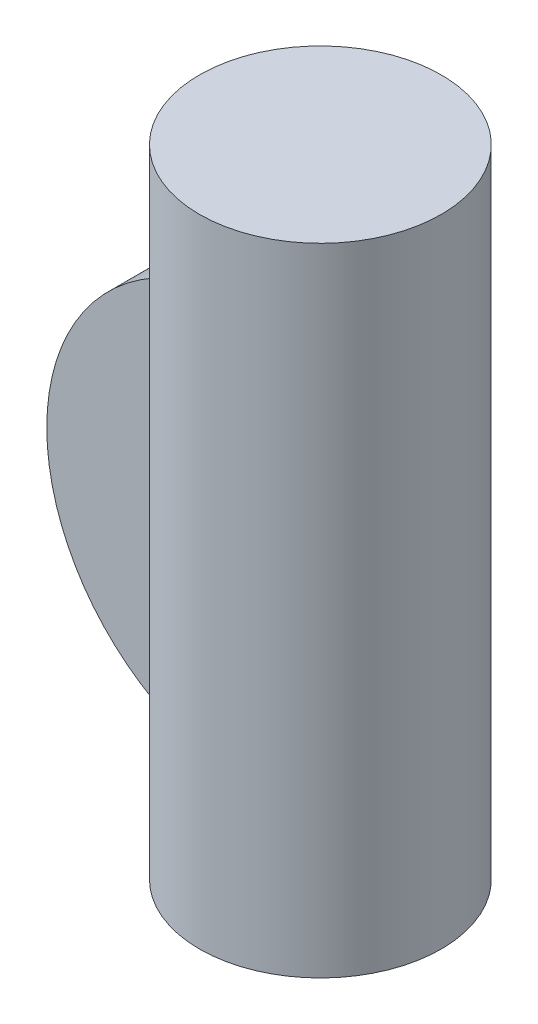
ISO-10303-21;
HEADER;
FILE_DESCRIPTION(('STEP AP214'),'2;1');
FILE_NAME('part.step','',(''),(''),'','','');
FILE_SCHEMA(('AUTOMOTIVE_DESIGN { 1 0 10303 214 1 1 1 1 }'));
ENDSEC;
DATA;
#1=APPLICATION_CONTEXT('core data for automotive mechanical design processes');
#2=APPLICATION_PROTOCOL_DEFINITION('international standard','automotive_design',2000,#1);
#3=PRODUCT_CONTEXT('',#1,'mechanical');
#4=PRODUCT('Part','Part','',(#3));
#5=PRODUCT_RELATED_PRODUCT_CATEGORY('part','',(#4));
#6=PRODUCT_DEFINITION_FORMATION('','',#4);
#7=PRODUCT_DEFINITION_CONTEXT('part definition',#1,'design');
#8=PRODUCT_DEFINITION('design','',#6,#7);
#9=PRODUCT_DEFINITION_SHAPE('','',#8);
#10=(LENGTH_UNIT() NAMED_UNIT(*) SI_UNIT(.MILLI.,.METRE.));
#11=(NAMED_UNIT(*) PLANE_ANGLE_UNIT() SI_UNIT($,.RADIAN.));
#12=(NAMED_UNIT(*) SI_UNIT($,.STERADIAN.) SOLID_ANGLE_UNIT());
#13=UNCERTAINTY_MEASURE_WITH_UNIT(LENGTH_MEASURE(1.E-05),#10,'distance_accuracy_value','');
#14=(GEOMETRIC_REPRESENTATION_CONTEXT(3) GLOBAL_UNCERTAINTY_ASSIGNED_CONTEXT((#13)) GLOBAL_UNIT_ASSIGNED_CONTEXT((#10,
#11,#12)) REPRESENTATION_CONTEXT('',''));
#15=CARTESIAN_POINT('',(0.,0.,0.));
#16=DIRECTION('',(0.,0.,1.));
#17=DIRECTION('',(1.,0.,0.));
#18=AXIS2_PLACEMENT_3D('',#15,#16,#17);
#19=CARTESIAN_POINT('',(0.,12.7,0.));
#20=DIRECTION('',(0.,-1.,0.));
#21=DIRECTION('',(0.,0.,-1.));
#22=AXIS2_PLACEMENT_3D('',#19,#20,#21);
#23=CYLINDRICAL_SURFACE('',#22,2.413);
#24=CARTESIAN_POINT('',(0.,0.,0.));
#25=DIRECTION('',(0.,1.,0.));
#26=DIRECTION('',(0.,0.,1.));
#27=AXIS2_PLACEMENT_3D('',#24,#25,#26);
#28=CIRCLE('',#27,2.413);
#29=CARTESIAN_POINT('',(0.,0.,2.413));
#30=VERTEX_POINT('',#29);
#31=EDGE_CURVE('E103',#30,#30,#28,.T.);
#32=ORIENTED_EDGE('',*,*,#31,.T.);
#33=EDGE_LOOP('',(#32));
#34=FACE_BOUND('',#33,.T.);
#35=CARTESIAN_POINT('',(0.,12.7,0.));
#36=DIRECTION('',(0.,1.,0.));
#37=DIRECTION('',(0.,0.,1.));
#38=AXIS2_PLACEMENT_3D('',#35,#36,#37);
#39=CIRCLE('',#38,2.413);
#40=CARTESIAN_POINT('',(0.,12.7,2.413));
#41=VERTEX_POINT('',#40);
#42=EDGE_CURVE('E67',#41,#41,#39,.T.);
#43=ORIENTED_EDGE('',*,*,#42,.F.);
#44=EDGE_LOOP('',(#43));
#45=FACE_BOUND('',#44,.T.);
#46=DIRECTION('',(0.,-1.,0.));
#47=VECTOR('',#46,1.);
#48=CARTESIAN_POINT('',(-2.05174779151824,12.7,-1.27));
#49=LINE('',#48,#47);
#50=CARTESIAN_POINT('',(-2.05174779151824,10.0044236207643,-1.27));
#51=VERTEX_POINT('',#50);
#52=CARTESIAN_POINT('',(-2.05174779151824,2.69557637923571,-1.27));
#53=VERTEX_POINT('',#52);
#54=EDGE_CURVE('E11',#51,#53,#49,.T.);
#55=ORIENTED_EDGE('',*,*,#54,.F.);
#56=CARTESIAN_POINT('',(0.,10.541,-2.413));
#57=CARTESIAN_POINT('',(-0.124277637249228,10.5409940200185,-2.41299336304963));
#58=CARTESIAN_POINT('',(-0.248758355500067,10.5354113425692,-2.40333297175946));
#59=CARTESIAN_POINT('',(-0.494002380310563,10.5136143992874,-2.36516603636907));
#60=CARTESIAN_POINT('',(-0.614755685070034,10.497373759839,-2.33661273945595));
#61=CARTESIAN_POINT('',(-0.84849211339575,10.4559183213708,-2.26221126559808));
#62=CARTESIAN_POINT('',(-0.961509223811501,10.4307462446565,-2.21644536133677));
#63=CARTESIAN_POINT('',(-1.17795129399248,10.373612624699,-2.10940538553403));
#64=CARTESIAN_POINT('',(-1.28137866647483,10.3416527959062,-2.04813522930966));
#65=CARTESIAN_POINT('',(-1.48423338629655,10.2709555404946,-1.90682899998204));
#66=CARTESIAN_POINT('',(-1.58281960610189,10.2318938890336,-1.82575057314704));
#67=CARTESIAN_POINT('',(-1.76581321737876,10.1521533698034,-1.64943780472773));
#68=CARTESIAN_POINT('',(-1.85020356076299,10.1114726290898,-1.55418669786252));
#69=CARTESIAN_POINT('',(-2.01185971312618,10.0277800285415,-1.33976265924406));
#70=CARTESIAN_POINT('',(-2.08730169113426,9.98500889019922,-1.2191087272989));
#71=CARTESIAN_POINT('',(-2.21651615453764,9.90770101956303,-0.964335378286774));
#72=CARTESIAN_POINT('',(-2.27032181192059,9.87315171532192,-0.830236971227625));
#73=CARTESIAN_POINT('',(-2.34418169051724,9.8243051540268,-0.583160389834326));
#74=CARTESIAN_POINT('',(-2.36909939840019,9.80720354111209,-0.472191619686289));
#75=CARTESIAN_POINT('',(-2.40304368702526,9.78370164835962,-0.246784346127516));
#76=CARTESIAN_POINT('',(-2.41208769441688,9.7772896335322,-0.132349788198802));
#77=CARTESIAN_POINT('',(-2.41378185768347,9.77609690659586,0.096865990521768));
#78=CARTESIAN_POINT('',(-2.40640829735232,9.78133302093031,0.211647473307185));
#79=CARTESIAN_POINT('',(-2.37566187963837,9.80268679310376,0.438030021126774));
#80=CARTESIAN_POINT('',(-2.35227785449406,9.81881204632381,0.549628809504083));
#81=CARTESIAN_POINT('',(-2.29083746132534,9.85968380815242,0.766333326507967));
#82=CARTESIAN_POINT('',(-2.25285639879514,9.88438600652444,0.871469219759344));
#83=CARTESIAN_POINT('',(-2.16355198197181,9.93974629305387,1.07419596879215));
#84=CARTESIAN_POINT('',(-2.112223553229,9.97040664528091,1.17178393662869));
#85=CARTESIAN_POINT('',(-1.98804553494693,10.0402587502311,1.37348348059103));
#86=CARTESIAN_POINT('',(-1.91305416570196,10.0800272358213,1.47607830241487));
#87=CARTESIAN_POINT('',(-1.74804635345664,10.1601496204782,1.66822114510697));
#88=CARTESIAN_POINT('',(-1.65801685218052,10.2005040002517,1.75775769922445));
#89=CARTESIAN_POINT('',(-1.45282681720777,10.2828578770022,1.93184218344593));
#90=CARTESIAN_POINT('',(-1.33595635743975,10.3244935334549,2.01456778903394));
#91=CARTESIAN_POINT('',(-1.08740955700763,10.3995467016589,2.15886888745384));
#92=CARTESIAN_POINT('',(-0.955742459094785,10.4329693025854,2.22045748714923));
#93=CARTESIAN_POINT('',(-0.690573861147793,10.4857690045796,2.31606316964933));
#94=CARTESIAN_POINT('',(-0.557814827883166,10.505950916336,2.35167894441401));
#95=CARTESIAN_POINT('',(-0.286915343507005,10.5333749000779,2.3998162976974));
#96=CARTESIAN_POINT('',(-0.148780506736776,10.5406301204284,2.41236134299281));
#97=CARTESIAN_POINT('',(0.110480615109437,10.5412989577698,2.4135159417579));
#98=CARTESIAN_POINT('',(0.231601331523145,10.5363108314319,2.40488928405349));
#99=CARTESIAN_POINT('',(0.470351993641351,10.5162447972409,2.36978740966585));
#100=CARTESIAN_POINT('',(0.587981896117345,10.5011667644938,2.34331197204842));
#101=CARTESIAN_POINT('',(0.815243367366012,10.462542108815,2.27418048620141));
#102=CARTESIAN_POINT('',(0.924955000754998,10.4391010348016,2.23172575899148));
#103=CARTESIAN_POINT('',(1.13575746981125,10.3856382300467,2.13218763608001));
#104=CARTESIAN_POINT('',(1.23684628368958,10.3556149618402,2.07510082209646));
#105=CARTESIAN_POINT('',(1.43888724822221,10.2878405204102,1.94122473706034));
#106=CARTESIAN_POINT('',(1.5387271493804,10.2496100519732,1.86300214228886));
#107=CARTESIAN_POINT('',(1.72463887696221,10.1710354029841,1.69237663170828));
#108=CARTESIAN_POINT('',(1.81069459977375,10.1306888222147,1.5999573736822));
#109=CARTESIAN_POINT('',(1.97664578442751,10.0468826764234,1.391119100108));
#110=CARTESIAN_POINT('',(2.05470893242076,10.0035953329166,1.27316388896186));
#111=CARTESIAN_POINT('',(2.18974765456304,9.92430285549781,1.02354341292712));
#112=CARTESIAN_POINT('',(2.2467505892016,9.88828830089607,0.891896223187658));
#113=CARTESIAN_POINT('',(2.32732248486878,9.8356640986138,0.647287305484953));
#114=CARTESIAN_POINT('',(2.35543805271512,9.81655013360204,0.536365173091407));
#115=CARTESIAN_POINT('',(2.39569074505154,9.78886072312772,0.31042359747855));
#116=CARTESIAN_POINT('',(2.40784666421774,9.7802728825029,0.195409137852801));
#117=CARTESIAN_POINT('',(2.4155106034754,9.77488201669864,-0.0357196611619962));
#118=CARTESIAN_POINT('',(2.41098122290393,9.77810546684024,-0.151835888877429));
#119=CARTESIAN_POINT('',(2.38547130861108,9.79590115916865,-0.381379951471876));
#120=CARTESIAN_POINT('',(2.36448046464044,9.81048051381953,-0.494806055569871));
#121=CARTESIAN_POINT('',(2.30778588617826,9.8485318164777,-0.713584798834544));
#122=CARTESIAN_POINT('',(2.27240903604877,9.87180531368022,-0.819058760763659));
#123=CARTESIAN_POINT('',(2.18828821460808,9.92468001668123,-1.02280335365467));
#124=CARTESIAN_POINT('',(2.13953938297278,9.95428352238838,-1.12107134896793));
#125=CARTESIAN_POINT('',(2.02137030130052,10.0220374463545,-1.32379882609085));
#126=CARTESIAN_POINT('',(1.949920099365,10.0608017340054,-1.42686979460781));
#127=CARTESIAN_POINT('',(1.79219802627501,10.1394966575978,-1.62055993545985));
#128=CARTESIAN_POINT('',(1.70591294975642,10.179428306161,-1.7111678832798));
#129=CARTESIAN_POINT('',(1.50763234840602,10.262097426136,-1.88934133554991));
#130=CARTESIAN_POINT('',(1.39375186370449,10.3045228996838,-1.974973345334));
#131=CARTESIAN_POINT('',(1.15079430635549,10.3819161599196,-2.12570475084521));
#132=CARTESIAN_POINT('',(1.02172585136317,10.4168881443508,-2.19081571380201));
#133=CARTESIAN_POINT('',(0.775887217839013,10.4701199692136,-2.28797014814794));
#134=CARTESIAN_POINT('',(0.661025029190498,10.4902474887708,-2.32383890813863));
#135=CARTESIAN_POINT('',(0.426193087641429,10.5209426327873,-2.37810038989842));
#136=CARTESIAN_POINT('',(0.306238790322241,10.5315372838142,-2.39654252527444));
#137=CARTESIAN_POINT('',(0.154682634412064,10.5382596582669,-2.40823725755627));
#138=CARTESIAN_POINT('',(0.123787155969279,10.5392856545917,-2.4100214431603));
#139=CARTESIAN_POINT('',(0.0619319944020345,10.5406566123504,-2.41240371408687));
#140=CARTESIAN_POINT('',(0.0309723038745233,10.5410014903229,-2.41300165405175));
#141=CARTESIAN_POINT('',(0.,10.541,-2.413));
#142=B_SPLINE_CURVE_WITH_KNOTS('',3,(#56,#57,#58,#59,#60,#61,#62,#63,#64,#65,#66,#67,#68,#69,
#70,#71,#72,#73,#74,#75,#76,#77,#78,#79,#80,#81,#82,#83,#84,#85,#86,#87,#88,#89,#90,#91,#92,#93,
#94,#95,#96,#97,#98,#99,#100,#101,#102,#103,#104,#105,#106,#107,#108,#109,#110,#111,#112,#113,
#114,#115,#116,#117,#118,#119,#120,#121,#122,#123,#124,#125,#126,#127,#128,#129,#130,#131,#132,
#133,#134,#135,#136,#137,#138,#139,#140,#141),.UNSPECIFIED.,.T.,.F.,(4,2,2,2,2,2,2,2,2,2,2,2,2,
2,2,2,2,2,2,2,2,2,2,2,2,2,2,2,2,2,2,2,2,2,2,2,2,2,2,2,2,2,4),(0.,0.372702340950793,
0.746330446291562,1.11819492640343,1.48996559245235,1.88883581154644,2.28818167339682,
2.73175035215363,3.17463635130993,3.51818170684623,3.86134967098506,4.20501368434449,
4.54891765782012,4.89107075797776,5.23335412979911,5.63125730461678,6.02950780988746,
6.47455270583274,6.91932113277554,7.33364541632614,7.74754802943894,8.1103516312963,
8.47315972405974,8.83154205474068,9.19000818551393,9.58583364168313,9.98211820733879,
10.4237582321418,10.8648224633896,11.2113893076917,11.5575476548123,11.9044823992155,
12.2516346117246,12.5913040631559,12.9310971384643,13.3233800388856,13.7160139578457,
14.1597891361173,14.6033137195541,14.9677898136061,15.3312292981264,15.424102289503,
15.51698666045),.UNSPECIFIED.);
#143=CARTESIAN_POINT('',(-2.05174779151824,10.0044236207643,1.27));
#144=VERTEX_POINT('',#143);
#145=EDGE_CURVE('E43',#51,#144,#142,.T.);
#146=ORIENTED_EDGE('',*,*,#145,.T.);
#147=DIRECTION('',(0.,-1.,0.));
#148=VECTOR('',#147,1.);
#149=CARTESIAN_POINT('',(-2.05174779151824,12.7,1.27));
#150=LINE('',#149,#148);
#151=CARTESIAN_POINT('',(-2.05174779151824,2.69557637923571,1.27));
#152=VERTEX_POINT('',#151);
#153=EDGE_CURVE('E61',#144,#152,#150,.T.);
#154=ORIENTED_EDGE('',*,*,#153,.T.);
#155=CARTESIAN_POINT('',(0.,2.159,-2.413));
#156=CARTESIAN_POINT('',(0.124277637249228,2.15900597998153,-2.41299336304963));
#157=CARTESIAN_POINT('',(0.248758355500067,2.16458865743084,-2.40333297175946));
#158=CARTESIAN_POINT('',(0.494002380310563,2.18638560071258,-2.36516603636907));
#159=CARTESIAN_POINT('',(0.614755685070034,2.20262624016097,-2.33661273945595));
#160=CARTESIAN_POINT('',(0.84849211339575,2.24408167862919,-2.26221126559808));
#161=CARTESIAN_POINT('',(0.961509223811501,2.26925375534349,-2.21644536133677));
#162=CARTESIAN_POINT('',(1.17795129399248,2.32638737530097,-2.10940538553403));
#163=CARTESIAN_POINT('',(1.28137866647483,2.35834720409377,-2.04813522930966));
#164=CARTESIAN_POINT('',(1.48423338629655,2.42904445950536,-1.90682899998204));
#165=CARTESIAN_POINT('',(1.58281960610189,2.46810611096637,-1.82575057314704));
#166=CARTESIAN_POINT('',(1.76581321737876,2.54784663019659,-1.64943780472773));
#167=CARTESIAN_POINT('',(1.85020356076299,2.58852737091023,-1.55418669786252));
#168=CARTESIAN_POINT('',(2.01185971312618,2.67221997145854,-1.33976265924406));
#169=CARTESIAN_POINT('',(2.08730169113426,2.71499110980078,-1.2191087272989));
#170=CARTESIAN_POINT('',(2.21651615453764,2.79229898043697,-0.964335378286774));
#171=CARTESIAN_POINT('',(2.27032181192059,2.82684828467808,-0.830236971227626));
#172=CARTESIAN_POINT('',(2.34418169051724,2.8756948459732,-0.583160389834327));
#173=CARTESIAN_POINT('',(2.36909939840019,2.89279645888791,-0.47219161968629));
#174=CARTESIAN_POINT('',(2.40304368702526,2.91629835164038,-0.246784346127517));
#175=CARTESIAN_POINT('',(2.41208769441688,2.9227103664678,-0.132349788198803));
#176=CARTESIAN_POINT('',(2.41378185768347,2.92390309340414,0.0968659905217672));
#177=CARTESIAN_POINT('',(2.40640829735232,2.91866697906969,0.211647473307184));
#178=CARTESIAN_POINT('',(2.37566187963837,2.89731320689624,0.438030021126773));
#179=CARTESIAN_POINT('',(2.35227785449406,2.88118795367619,0.549628809504083));
#180=CARTESIAN_POINT('',(2.29083746132534,2.84031619184758,0.766333326507965));
#181=CARTESIAN_POINT('',(2.25285639879514,2.81561399347555,0.871469219759342));
#182=CARTESIAN_POINT('',(2.16355198197181,2.76025370694613,1.07419596879215));
#183=CARTESIAN_POINT('',(2.112223553229,2.7295933547191,1.17178393662869));
#184=CARTESIAN_POINT('',(1.98804553494693,2.65974124976889,1.37348348059103));
#185=CARTESIAN_POINT('',(1.91305416570197,2.61997276417874,1.47607830241487));
#186=CARTESIAN_POINT('',(1.74804635345664,2.53985037952179,1.66822114510697));
#187=CARTESIAN_POINT('',(1.65801685218052,2.49949599974833,1.75775769922445));
#188=CARTESIAN_POINT('',(1.45282681720777,2.41714212299783,1.93184218344593));
#189=CARTESIAN_POINT('',(1.33595635743975,2.37550646654513,2.01456778903394));
#190=CARTESIAN_POINT('',(1.08740955700763,2.30045329834112,2.15886888745384));
#191=CARTESIAN_POINT('',(0.955742459094786,2.26703069741456,2.22045748714923));
#192=CARTESIAN_POINT('',(0.690573861147793,2.2142309954204,2.31606316964933));
#193=CARTESIAN_POINT('',(0.557814827883167,2.19404908366403,2.35167894441401));
#194=CARTESIAN_POINT('',(0.286915343507006,2.16662509992212,2.3998162976974));
#195=CARTESIAN_POINT('',(0.148780506736777,2.15936987957162,2.41236134299281));
#196=CARTESIAN_POINT('',(-0.110480615109437,2.15870104223019,2.4135159417579));
#197=CARTESIAN_POINT('',(-0.231601331523146,2.16368916856809,2.40488928405349));
#198=CARTESIAN_POINT('',(-0.470351993641352,2.1837552027591,2.36978740966585));
#199=CARTESIAN_POINT('',(-0.587981896117346,2.19883323550618,2.34331197204842));
#200=CARTESIAN_POINT('',(-0.815243367366012,2.23745789118503,2.27418048620141));
#201=CARTESIAN_POINT('',(-0.924955000754998,2.26089896519844,2.23172575899148));
#202=CARTESIAN_POINT('',(-1.13575746981125,2.31436176995329,2.13218763608001));
#203=CARTESIAN_POINT('',(-1.23684628368958,2.34438503815982,2.07510082209646));
#204=CARTESIAN_POINT('',(-1.43888724822221,2.41215947958978,1.94122473706034));
#205=CARTESIAN_POINT('',(-1.5387271493804,2.45038994802678,1.86300214228886));
#206=CARTESIAN_POINT('',(-1.72463887696221,2.52896459701589,1.69237663170828));
#207=CARTESIAN_POINT('',(-1.81069459977375,2.56931117778535,1.5999573736822));
#208=CARTESIAN_POINT('',(-1.97664578442751,2.65311732357656,1.391119100108));
#209=CARTESIAN_POINT('',(-2.05470893242076,2.69640466708336,1.27316388896186));
#210=CARTESIAN_POINT('',(-2.18974765456304,2.77569714450219,1.02354341292712));
#211=CARTESIAN_POINT('',(-2.2467505892016,2.81171169910393,0.891896223187658));
#212=CARTESIAN_POINT('',(-2.32732248486878,2.8643359013862,0.647287305484953));
#213=CARTESIAN_POINT('',(-2.35543805271512,2.88344986639796,0.536365173091407));
#214=CARTESIAN_POINT('',(-2.39569074505154,2.91113927687228,0.310423597478549));
#215=CARTESIAN_POINT('',(-2.40784666421774,2.9197271174971,0.195409137852801));
#216=CARTESIAN_POINT('',(-2.4155106034754,2.92511798330136,-0.0357196611619966));
#217=CARTESIAN_POINT('',(-2.41098122290393,2.92189453315976,-0.15183588887743));
#218=CARTESIAN_POINT('',(-2.38547130861108,2.90409884083136,-0.381379951471877));
#219=CARTESIAN_POINT('',(-2.36448046464044,2.88951948618047,-0.494806055569871));
#220=CARTESIAN_POINT('',(-2.30778588617826,2.8514681835223,-0.713584798834544));
#221=CARTESIAN_POINT('',(-2.27240903604877,2.82819468631978,-0.819058760763659));
#222=CARTESIAN_POINT('',(-2.18828821460808,2.77531998331877,-1.02280335365467));
#223=CARTESIAN_POINT('',(-2.13953938297278,2.74571647761162,-1.12107134896793));
#224=CARTESIAN_POINT('',(-2.02137030130052,2.67796255364552,-1.32379882609086));
#225=CARTESIAN_POINT('',(-1.949920099365,2.63919826599463,-1.42686979460781));
#226=CARTESIAN_POINT('',(-1.79219802627501,2.56050334240224,-1.62055993545985));
#227=CARTESIAN_POINT('',(-1.70591294975642,2.52057169383896,-1.7111678832798));
#228=CARTESIAN_POINT('',(-1.50763234840602,2.43790257386404,-1.88934133554991));
#229=CARTESIAN_POINT('',(-1.39375186370449,2.39547710031616,-1.974973345334));
#230=CARTESIAN_POINT('',(-1.15079430635549,2.31808384008038,-2.12570475084521));
#231=CARTESIAN_POINT('',(-1.02172585136317,2.28311185564924,-2.19081571380201));
#232=CARTESIAN_POINT('',(-0.775887217839012,2.22988003078642,-2.28797014814794));
#233=CARTESIAN_POINT('',(-0.661025029190498,2.20975251122917,-2.32383890813863));
#234=CARTESIAN_POINT('',(-0.426193087641429,2.1790573672127,-2.37810038989842));
#235=CARTESIAN_POINT('',(-0.30623879032224,2.16846271618579,-2.39654252527444));
#236=CARTESIAN_POINT('',(-0.154682634412063,2.16174034173309,-2.40823725755627));
#237=CARTESIAN_POINT('',(-0.123787155969279,2.16071434540831,-2.4100214431603));
#238=CARTESIAN_POINT('',(-0.0619319944020343,2.1593433876496,-2.41240371408687));
#239=CARTESIAN_POINT('',(-0.0309723038745232,2.15899850967713,-2.41300165405175));
#240=CARTESIAN_POINT('',(0.,2.159,-2.413));
#241=B_SPLINE_CURVE_WITH_KNOTS('',3,(#155,#156,#157,#158,#159,#160,#161,#162,#163,#164,#165,
#166,#167,#168,#169,#170,#171,#172,#173,#174,#175,#176,#177,#178,#179,#180,#181,#182,#183,#184,
#185,#186,#187,#188,#189,#190,#191,#192,#193,#194,#195,#196,#197,#198,#199,#200,#201,#202,#203,
#204,#205,#206,#207,#208,#209,#210,#211,#212,#213,#214,#215,#216,#217,#218,#219,#220,#221,#222,
#223,#224,#225,#226,#227,#228,#229,#230,#231,#232,#233,#234,#235,#236,#237,#238,#239,#240),
.UNSPECIFIED.,.T.,.F.,(4,2,2,2,2,2,2,2,2,2,2,2,2,2,2,2,2,2,2,2,2,2,2,2,2,2,2,2,2,2,2,2,2,2,2,2,
2,2,2,2,2,2,4),(0.,0.372702340950793,0.746330446291562,1.11819492640343,1.48996559245235,
1.88883581154644,2.28818167339682,2.73175035215363,3.17463635130992,3.51818170684622,
3.86134967098506,4.20501368434449,4.54891765782012,4.89107075797776,5.23335412979911,
5.63125730461678,6.02950780988746,6.47455270583273,6.91932113277554,7.33364541632614,
7.74754802943894,8.1103516312963,8.47315972405974,8.83154205474068,9.19000818551393,
9.58583364168313,9.98211820733879,10.4237582321418,10.8648224633896,11.2113893076917,
11.5575476548123,11.9044823992155,12.2516346117246,12.5913040631559,12.9310971384643,
13.3233800388856,13.7160139578457,14.1597891361173,14.6033137195541,14.9677898136061,
15.3312292981264,15.424102289503,15.51698666045),.UNSPECIFIED.);
#242=EDGE_CURVE('E66',#152,#53,#241,.T.);
#243=ORIENTED_EDGE('',*,*,#242,.T.);
#244=EDGE_LOOP('',(#55,#146,#154,#243));
#245=FACE_BOUND('',#244,.T.);
#246=ADVANCED_FACE('F35',(#34,#45,#245),#23,.T.);
#247=CARTESIAN_POINT('',(0.,12.7,0.));
#248=DIRECTION('',(0.,1.,0.));
#249=DIRECTION('',(0.,0.,1.));
#250=AXIS2_PLACEMENT_3D('',#247,#248,#249);
#251=PLANE('',#250);
#252=ORIENTED_EDGE('',*,*,#42,.T.);
#253=EDGE_LOOP('',(#252));
#254=FACE_BOUND('',#253,.T.);
#255=ADVANCED_FACE('F88',(#254),#251,.T.);
#256=CARTESIAN_POINT('',(0.,0.,0.));
#257=DIRECTION('',(0.,1.,0.));
#258=DIRECTION('',(0.,0.,1.));
#259=AXIS2_PLACEMENT_3D('',#256,#257,#258);
#260=PLANE('',#259);
#261=ORIENTED_EDGE('',*,*,#31,.F.);
#262=EDGE_LOOP('',(#261));
#263=FACE_BOUND('',#262,.T.);
#264=ADVANCED_FACE('F86',(#263),#260,.F.);
#265=CARTESIAN_POINT('',(0.,6.35,-1.27));
#266=DIRECTION('',(0.,0.,1.));
#267=DIRECTION('',(1.,0.,0.));
#268=AXIS2_PLACEMENT_3D('',#265,#266,#267);
#269=CYLINDRICAL_SURFACE('',#268,4.191);
#270=ORIENTED_EDGE('',*,*,#145,.F.);
#271=CARTESIAN_POINT('',(0.,6.35,-1.27));
#272=DIRECTION('',(0.,0.,1.));
#273=DIRECTION('',(1.,0.,0.));
#274=AXIS2_PLACEMENT_3D('',#271,#272,#273);
#275=CIRCLE('',#274,4.191);
#276=EDGE_CURVE('E71',#51,#53,#275,.T.);
#277=ORIENTED_EDGE('',*,*,#276,.T.);
#278=ORIENTED_EDGE('',*,*,#242,.F.);
#279=CARTESIAN_POINT('',(0.,6.35,1.27));
#280=DIRECTION('',(0.,0.,1.));
#281=DIRECTION('',(1.,0.,0.));
#282=AXIS2_PLACEMENT_3D('',#279,#280,#281);
#283=CIRCLE('',#282,4.191);
#284=EDGE_CURVE('E49',#144,#152,#283,.T.);
#285=ORIENTED_EDGE('',*,*,#284,.F.);
#286=EDGE_LOOP('',(#270,#277,#278,#285));
#287=FACE_BOUND('',#286,.T.);
#288=ADVANCED_FACE('F70',(#287),#269,.T.);
#289=CARTESIAN_POINT('',(0.,0.,-1.27));
#290=DIRECTION('',(0.,0.,1.));
#291=DIRECTION('',(1.,0.,0.));
#292=AXIS2_PLACEMENT_3D('',#289,#290,#291);
#293=PLANE('',#292);
#294=ORIENTED_EDGE('',*,*,#276,.F.);
#295=ORIENTED_EDGE('',*,*,#54,.T.);
#296=EDGE_LOOP('',(#294,#295));
#297=FACE_BOUND('',#296,.T.);
#298=ADVANCED_FACE('F85',(#297),#293,.F.);
#299=CARTESIAN_POINT('',(0.,0.,1.27));
#300=DIRECTION('',(0.,0.,1.));
#301=DIRECTION('',(1.,0.,0.));
#302=AXIS2_PLACEMENT_3D('',#299,#300,#301);
#303=PLANE('',#302);
#304=ORIENTED_EDGE('',*,*,#153,.F.);
#305=ORIENTED_EDGE('',*,*,#284,.T.);
#306=EDGE_LOOP('',(#304,#305));
#307=FACE_BOUND('',#306,.T.);
#308=ADVANCED_FACE('F62',(#307),#303,.T.);
#309=CLOSED_SHELL('',(#246,#255,#264,#288,#298,#308));
#310=MANIFOLD_SOLID_BREP('B2',#309);
#311=ADVANCED_BREP_SHAPE_REPRESENTATION('',(#18,#310),#14);
#312=SHAPE_DEFINITION_REPRESENTATION(#9,#311);
ENDSEC;
END-ISO-10303-21;
